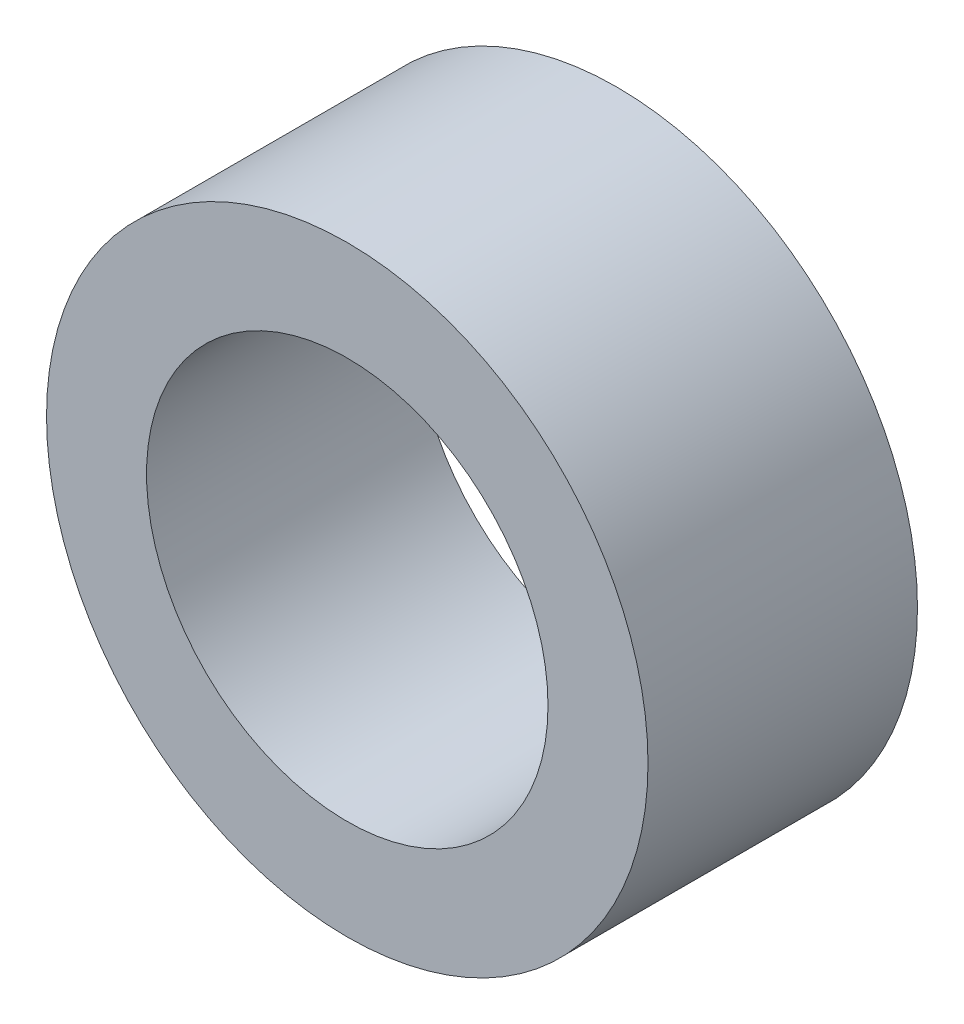
ISO-10303-21;
HEADER;
FILE_DESCRIPTION(('STEP AP214'),'2;1');
FILE_NAME('part.step','',(''),(''),'','','');
FILE_SCHEMA(('AUTOMOTIVE_DESIGN { 1 0 10303 214 1 1 1 1 }'));
ENDSEC;
DATA;
#1=APPLICATION_CONTEXT('core data for automotive mechanical design processes');
#2=APPLICATION_PROTOCOL_DEFINITION('international standard','automotive_design',2000,#1);
#3=PRODUCT_CONTEXT('',#1,'mechanical');
#4=PRODUCT('Part','Part','',(#3));
#5=PRODUCT_RELATED_PRODUCT_CATEGORY('part','',(#4));
#6=PRODUCT_DEFINITION_FORMATION('','',#4);
#7=PRODUCT_DEFINITION_CONTEXT('part definition',#1,'design');
#8=PRODUCT_DEFINITION('design','',#6,#7);
#9=PRODUCT_DEFINITION_SHAPE('','',#8);
#10=(LENGTH_UNIT() NAMED_UNIT(*) SI_UNIT(.MILLI.,.METRE.));
#11=(NAMED_UNIT(*) PLANE_ANGLE_UNIT() SI_UNIT($,.RADIAN.));
#12=(NAMED_UNIT(*) SI_UNIT($,.STERADIAN.) SOLID_ANGLE_UNIT());
#13=UNCERTAINTY_MEASURE_WITH_UNIT(LENGTH_MEASURE(1.E-05),#10,'distance_accuracy_value','');
#14=(GEOMETRIC_REPRESENTATION_CONTEXT(3) GLOBAL_UNCERTAINTY_ASSIGNED_CONTEXT((#13)) GLOBAL_UNIT_ASSIGNED_CONTEXT((#10,
#11,#12)) REPRESENTATION_CONTEXT('',''));
#15=CARTESIAN_POINT('',(0.,0.,0.));
#16=DIRECTION('',(0.,0.,1.));
#17=DIRECTION('',(1.,0.,0.));
#18=AXIS2_PLACEMENT_3D('',#15,#16,#17);
#19=CARTESIAN_POINT('',(0.,0.,-2.1336));
#20=DIRECTION('',(0.,0.,1.));
#21=DIRECTION('',(1.,0.,0.));
#22=AXIS2_PLACEMENT_3D('',#19,#20,#21);
#23=CYLINDRICAL_SURFACE('',#22,4.7625);
#24=CARTESIAN_POINT('',(0.,0.,-2.1336));
#25=DIRECTION('',(0.,0.,1.));
#26=DIRECTION('',(1.,0.,0.));
#27=AXIS2_PLACEMENT_3D('',#24,#25,#26);
#28=CIRCLE('',#27,4.7625);
#29=CARTESIAN_POINT('',(4.7625,0.,-2.1336));
#30=VERTEX_POINT('',#29);
#31=EDGE_CURVE('E10',#30,#30,#28,.T.);
#32=ORIENTED_EDGE('',*,*,#31,.T.);
#33=EDGE_LOOP('',(#32));
#34=FACE_BOUND('',#33,.T.);
#35=CARTESIAN_POINT('',(0.,0.,2.1336));
#36=DIRECTION('',(0.,0.,1.));
#37=DIRECTION('',(1.,0.,0.));
#38=AXIS2_PLACEMENT_3D('',#35,#36,#37);
#39=CIRCLE('',#38,4.7625);
#40=CARTESIAN_POINT('',(4.7625,0.,2.1336));
#41=VERTEX_POINT('',#40);
#42=EDGE_CURVE('E57',#41,#41,#39,.T.);
#43=ORIENTED_EDGE('',*,*,#42,.F.);
#44=EDGE_LOOP('',(#43));
#45=FACE_BOUND('',#44,.T.);
#46=ADVANCED_FACE('F45',(#34,#45),#23,.T.);
#47=CARTESIAN_POINT('',(0.,0.,-2.1336));
#48=DIRECTION('',(0.,0.,1.));
#49=DIRECTION('',(1.,0.,0.));
#50=AXIS2_PLACEMENT_3D('',#47,#48,#49);
#51=PLANE('',#50);
#52=CARTESIAN_POINT('',(0.,0.,-2.1336));
#53=DIRECTION('',(0.,0.,1.));
#54=DIRECTION('',(1.,0.,0.));
#55=AXIS2_PLACEMENT_3D('',#52,#53,#54);
#56=CIRCLE('',#55,3.17881);
#57=CARTESIAN_POINT('',(3.17881,0.,-2.1336));
#58=VERTEX_POINT('',#57);
#59=EDGE_CURVE('E52',#58,#58,#56,.T.);
#60=ORIENTED_EDGE('',*,*,#59,.T.);
#61=EDGE_LOOP('',(#60));
#62=FACE_BOUND('',#61,.T.);
#63=ORIENTED_EDGE('',*,*,#31,.F.);
#64=EDGE_LOOP('',(#63));
#65=FACE_BOUND('',#64,.T.);
#66=ADVANCED_FACE('F77',(#62,#65),#51,.F.);
#67=CARTESIAN_POINT('',(0.,0.,-2.1336));
#68=DIRECTION('',(0.,0.,1.));
#69=DIRECTION('',(1.,0.,0.));
#70=AXIS2_PLACEMENT_3D('',#67,#68,#69);
#71=CYLINDRICAL_SURFACE('',#70,3.17881);
#72=ORIENTED_EDGE('',*,*,#59,.F.);
#73=EDGE_LOOP('',(#72));
#74=FACE_BOUND('',#73,.T.);
#75=CARTESIAN_POINT('',(0.,0.,2.1336));
#76=DIRECTION('',(0.,0.,1.));
#77=DIRECTION('',(1.,0.,0.));
#78=AXIS2_PLACEMENT_3D('',#75,#76,#77);
#79=CIRCLE('',#78,3.17881);
#80=CARTESIAN_POINT('',(3.17881,0.,2.1336));
#81=VERTEX_POINT('',#80);
#82=EDGE_CURVE('E63',#81,#81,#79,.T.);
#83=ORIENTED_EDGE('',*,*,#82,.T.);
#84=EDGE_LOOP('',(#83));
#85=FACE_BOUND('',#84,.T.);
#86=ADVANCED_FACE('F69',(#74,#85),#71,.F.);
#87=CARTESIAN_POINT('',(0.,0.,2.1336));
#88=DIRECTION('',(0.,0.,1.));
#89=DIRECTION('',(1.,0.,0.));
#90=AXIS2_PLACEMENT_3D('',#87,#88,#89);
#91=PLANE('',#90);
#92=ORIENTED_EDGE('',*,*,#42,.T.);
#93=EDGE_LOOP('',(#92));
#94=FACE_BOUND('',#93,.T.);
#95=ORIENTED_EDGE('',*,*,#82,.F.);
#96=EDGE_LOOP('',(#95));
#97=FACE_BOUND('',#96,.T.);
#98=ADVANCED_FACE('F71',(#94,#97),#91,.T.);
#99=CLOSED_SHELL('',(#46,#66,#86,#98));
#100=MANIFOLD_SOLID_BREP('B2',#99);
#101=ADVANCED_BREP_SHAPE_REPRESENTATION('',(#18,#100),#14);
#102=SHAPE_DEFINITION_REPRESENTATION(#9,#101);
ENDSEC;
END-ISO-10303-21;
